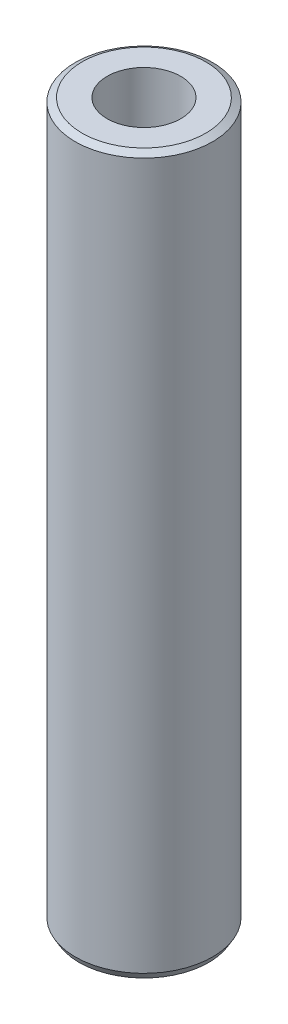
ISO-10303-21;
HEADER;
FILE_DESCRIPTION(('STEP AP214'),'2;1');
FILE_NAME('part.step','',(''),(''),'','','');
FILE_SCHEMA(('AUTOMOTIVE_DESIGN { 1 0 10303 214 1 1 1 1 }'));
ENDSEC;
DATA;
#1=APPLICATION_CONTEXT('core data for automotive mechanical design processes');
#2=APPLICATION_PROTOCOL_DEFINITION('international standard','automotive_design',2000,#1);
#3=PRODUCT_CONTEXT('',#1,'mechanical');
#4=PRODUCT('Part','Part','',(#3));
#5=PRODUCT_RELATED_PRODUCT_CATEGORY('part','',(#4));
#6=PRODUCT_DEFINITION_FORMATION('','',#4);
#7=PRODUCT_DEFINITION_CONTEXT('part definition',#1,'design');
#8=PRODUCT_DEFINITION('design','',#6,#7);
#9=PRODUCT_DEFINITION_SHAPE('','',#8);
#10=(LENGTH_UNIT() NAMED_UNIT(*) SI_UNIT(.MILLI.,.METRE.));
#11=(NAMED_UNIT(*) PLANE_ANGLE_UNIT() SI_UNIT($,.RADIAN.));
#12=(NAMED_UNIT(*) SI_UNIT($,.STERADIAN.) SOLID_ANGLE_UNIT());
#13=UNCERTAINTY_MEASURE_WITH_UNIT(LENGTH_MEASURE(1.E-05),#10,'distance_accuracy_value','');
#14=(GEOMETRIC_REPRESENTATION_CONTEXT(3) GLOBAL_UNCERTAINTY_ASSIGNED_CONTEXT((#13)) GLOBAL_UNIT_ASSIGNED_CONTEXT((#10,
#11,#12)) REPRESENTATION_CONTEXT('',''));
#15=CARTESIAN_POINT('',(0.,0.,0.));
#16=DIRECTION('',(0.,0.,1.));
#17=DIRECTION('',(1.,0.,0.));
#18=AXIS2_PLACEMENT_3D('',#15,#16,#17);
#19=CARTESIAN_POINT('',(0.,600.,0.));
#20=DIRECTION('',(0.,-1.,0.));
#21=DIRECTION('',(0.,0.,-1.));
#22=AXIS2_PLACEMENT_3D('',#19,#20,#21);
#23=CYLINDRICAL_SURFACE('',#22,57.5);
#24=CARTESIAN_POINT('',(0.,596.691754946248,0.));
#25=DIRECTION('',(0.,1.,0.));
#26=DIRECTION('',(0.,0.,1.));
#27=AXIS2_PLACEMENT_3D('',#24,#25,#26);
#28=CIRCLE('',#27,57.5);
#29=CARTESIAN_POINT('',(0.,596.691754946248,57.5));
#30=VERTEX_POINT('',#29);
#31=EDGE_CURVE('E50',#30,#30,#28,.F.);
#32=ORIENTED_EDGE('',*,*,#31,.T.);
#33=EDGE_LOOP('',(#32));
#34=FACE_BOUND('',#33,.T.);
#35=CARTESIAN_POINT('',(0.,5.73004851698655,0.));
#36=DIRECTION('',(0.,1.,0.));
#37=DIRECTION('',(0.,0.,1.));
#38=AXIS2_PLACEMENT_3D('',#35,#36,#37);
#39=CIRCLE('',#38,57.5);
#40=CARTESIAN_POINT('',(0.,5.73004851698655,57.5));
#41=VERTEX_POINT('',#40);
#42=EDGE_CURVE('E51',#41,#41,#39,.T.);
#43=ORIENTED_EDGE('',*,*,#42,.T.);
#44=EDGE_LOOP('',(#43));
#45=FACE_BOUND('',#44,.T.);
#46=ADVANCED_FACE('F39',(#34,#45),#23,.T.);
#47=CARTESIAN_POINT('',(0.,600.,0.));
#48=DIRECTION('',(0.,1.,0.));
#49=DIRECTION('',(0.,0.,1.));
#50=AXIS2_PLACEMENT_3D('',#47,#48,#49);
#51=PLANE('',#50);
#52=CARTESIAN_POINT('',(0.,600.,0.));
#53=DIRECTION('',(0.,1.,0.));
#54=DIRECTION('',(0.,0.,1.));
#55=AXIS2_PLACEMENT_3D('',#52,#53,#54);
#56=CIRCLE('',#55,51.7699514830133);
#57=CARTESIAN_POINT('',(0.,600.,51.7699514830133));
#58=VERTEX_POINT('',#57);
#59=EDGE_CURVE('E54',#58,#58,#56,.T.);
#60=ORIENTED_EDGE('',*,*,#59,.T.);
#61=EDGE_LOOP('',(#60));
#62=FACE_BOUND('',#61,.T.);
#63=CARTESIAN_POINT('',(0.,600.,0.));
#64=DIRECTION('',(0.,1.,0.));
#65=DIRECTION('',(0.,0.,1.));
#66=AXIS2_PLACEMENT_3D('',#63,#64,#65);
#67=CIRCLE('',#66,30.8139340222525);
#68=CARTESIAN_POINT('',(0.,600.,30.8139340222525));
#69=VERTEX_POINT('',#68);
#70=EDGE_CURVE('E58',#69,#69,#67,.T.);
#71=ORIENTED_EDGE('',*,*,#70,.F.);
#72=EDGE_LOOP('',(#71));
#73=FACE_BOUND('',#72,.T.);
#74=ADVANCED_FACE('F69',(#62,#73),#51,.T.);
#75=CARTESIAN_POINT('',(0.,0.,0.));
#76=DIRECTION('',(0.,1.,0.));
#77=DIRECTION('',(0.,0.,1.));
#78=AXIS2_PLACEMENT_3D('',#75,#76,#77);
#79=PLANE('',#78);
#80=CARTESIAN_POINT('',(0.,0.,0.));
#81=DIRECTION('',(0.,1.,0.));
#82=DIRECTION('',(0.,0.,1.));
#83=AXIS2_PLACEMENT_3D('',#80,#81,#82);
#84=CIRCLE('',#83,54.1917549462482);
#85=CARTESIAN_POINT('',(0.,0.,54.1917549462482));
#86=VERTEX_POINT('',#85);
#87=EDGE_CURVE('E10',#86,#86,#84,.F.);
#88=ORIENTED_EDGE('',*,*,#87,.T.);
#89=EDGE_LOOP('',(#88));
#90=FACE_BOUND('',#89,.T.);
#91=CARTESIAN_POINT('',(0.,0.,0.));
#92=DIRECTION('',(0.,1.,0.));
#93=DIRECTION('',(0.,0.,1.));
#94=AXIS2_PLACEMENT_3D('',#91,#92,#93);
#95=CIRCLE('',#94,30.8139340222525);
#96=CARTESIAN_POINT('',(0.,0.,30.8139340222525));
#97=VERTEX_POINT('',#96);
#98=EDGE_CURVE('E63',#97,#97,#95,.T.);
#99=ORIENTED_EDGE('',*,*,#98,.T.);
#100=EDGE_LOOP('',(#99));
#101=FACE_BOUND('',#100,.T.);
#102=ADVANCED_FACE('F75',(#90,#101),#79,.F.);
#103=CARTESIAN_POINT('',(0.,600.,0.));
#104=DIRECTION('',(0.,-1.,0.));
#105=DIRECTION('',(0.,0.,-1.));
#106=AXIS2_PLACEMENT_3D('',#103,#104,#105);
#107=CYLINDRICAL_SURFACE('',#106,30.8139340222525);
#108=ORIENTED_EDGE('',*,*,#70,.T.);
#109=EDGE_LOOP('',(#108));
#110=FACE_BOUND('',#109,.T.);
#111=ORIENTED_EDGE('',*,*,#98,.F.);
#112=EDGE_LOOP('',(#111));
#113=FACE_BOUND('',#112,.T.);
#114=ADVANCED_FACE('F70',(#110,#113),#107,.F.);
#115=CARTESIAN_POINT('',(0.,600.,0.));
#116=DIRECTION('',(0.,-1.,0.));
#117=DIRECTION('',(0.,0.,-1.));
#118=AXIS2_PLACEMENT_3D('',#115,#116,#117);
#119=CONICAL_SURFACE('',#118,51.7699514830133,1.04719755119659);
#120=ORIENTED_EDGE('',*,*,#31,.F.);
#121=EDGE_LOOP('',(#120));
#122=FACE_BOUND('',#121,.T.);
#123=ORIENTED_EDGE('',*,*,#59,.F.);
#124=EDGE_LOOP('',(#123));
#125=FACE_BOUND('',#124,.T.);
#126=ADVANCED_FACE('F81',(#122,#125),#119,.T.);
#127=CARTESIAN_POINT('',(0.,5.73004851698655,0.));
#128=DIRECTION('',(0.,1.,0.));
#129=DIRECTION('',(0.,0.,1.));
#130=AXIS2_PLACEMENT_3D('',#127,#128,#129);
#131=CONICAL_SURFACE('',#130,57.5,0.523598775598303);
#132=ORIENTED_EDGE('',*,*,#87,.F.);
#133=EDGE_LOOP('',(#132));
#134=FACE_BOUND('',#133,.T.);
#135=ORIENTED_EDGE('',*,*,#42,.F.);
#136=EDGE_LOOP('',(#135));
#137=FACE_BOUND('',#136,.T.);
#138=ADVANCED_FACE('F45',(#134,#137),#131,.T.);
#139=CLOSED_SHELL('',(#46,#74,#102,#114,#126,#138));
#140=MANIFOLD_SOLID_BREP('B2',#139);
#141=ADVANCED_BREP_SHAPE_REPRESENTATION('',(#18,#140),#14);
#142=SHAPE_DEFINITION_REPRESENTATION(#9,#141);
ENDSEC;
END-ISO-10303-21;
